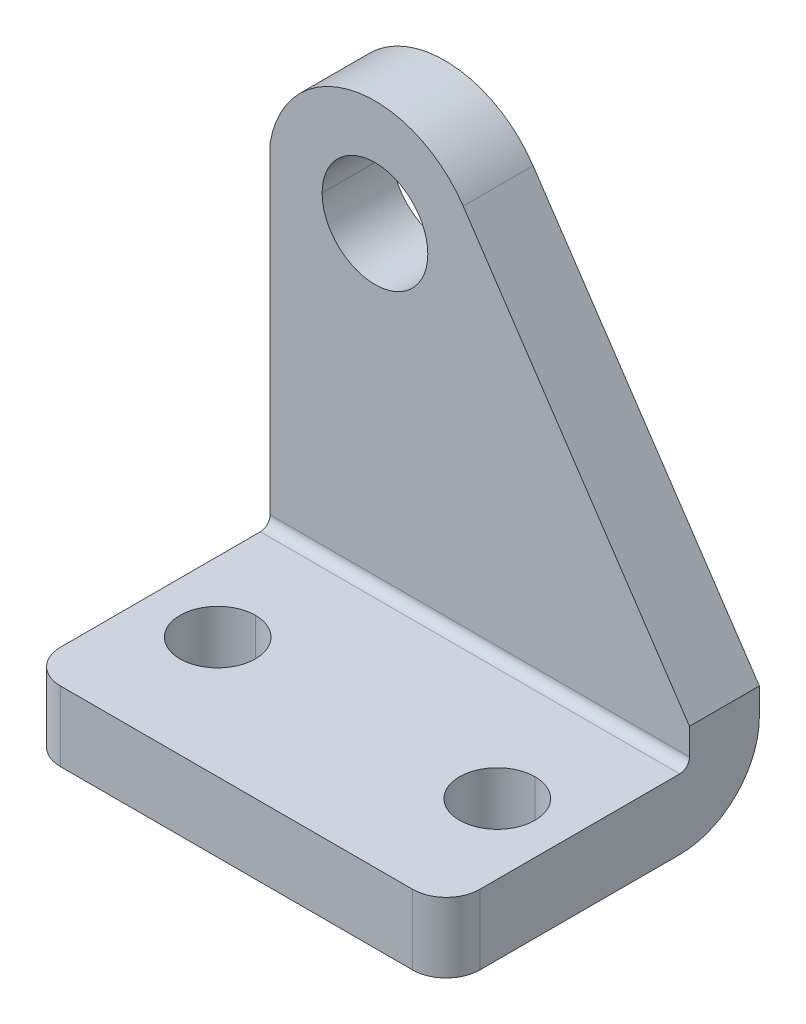
ISO-10303-21;
HEADER;
FILE_DESCRIPTION(('STEP AP214'),'2;1');
FILE_NAME('part.step','',(''),(''),'','','');
FILE_SCHEMA(('AUTOMOTIVE_DESIGN { 1 0 10303 214 1 1 1 1 }'));
ENDSEC;
DATA;
#1=APPLICATION_CONTEXT('core data for automotive mechanical design processes');
#2=APPLICATION_PROTOCOL_DEFINITION('international standard','automotive_design',2000,#1);
#3=PRODUCT_CONTEXT('',#1,'mechanical');
#4=PRODUCT('Part','Part','',(#3));
#5=PRODUCT_RELATED_PRODUCT_CATEGORY('part','',(#4));
#6=PRODUCT_DEFINITION_FORMATION('','',#4);
#7=PRODUCT_DEFINITION_CONTEXT('part definition',#1,'design');
#8=PRODUCT_DEFINITION('design','',#6,#7);
#9=PRODUCT_DEFINITION_SHAPE('','',#8);
#10=(LENGTH_UNIT() NAMED_UNIT(*) SI_UNIT(.MILLI.,.METRE.));
#11=(NAMED_UNIT(*) PLANE_ANGLE_UNIT() SI_UNIT($,.RADIAN.));
#12=(NAMED_UNIT(*) SI_UNIT($,.STERADIAN.) SOLID_ANGLE_UNIT());
#13=UNCERTAINTY_MEASURE_WITH_UNIT(LENGTH_MEASURE(1.E-05),#10,'distance_accuracy_value','');
#14=(GEOMETRIC_REPRESENTATION_CONTEXT(3) GLOBAL_UNCERTAINTY_ASSIGNED_CONTEXT((#13)) GLOBAL_UNIT_ASSIGNED_CONTEXT((#10,
#11,#12)) REPRESENTATION_CONTEXT('',''));
#15=CARTESIAN_POINT('',(0.,0.,0.));
#16=DIRECTION('',(0.,0.,1.));
#17=DIRECTION('',(1.,0.,0.));
#18=AXIS2_PLACEMENT_3D('',#15,#16,#17);
#19=CARTESIAN_POINT('',(38.1,6.35,7.239));
#20=DIRECTION('',(0.,-1.,0.));
#21=DIRECTION('',(0.,0.,-1.));
#22=AXIS2_PLACEMENT_3D('',#19,#20,#21);
#23=PLANE('',#22);
#24=CARTESIAN_POINT('',(6.35,6.35,17.4625));
#25=DIRECTION('',(0.,1.,0.));
#26=DIRECTION('',(0.,0.,1.));
#27=AXIS2_PLACEMENT_3D('',#24,#25,#26);
#28=CIRCLE('',#27,3.429);
#29=CARTESIAN_POINT('',(6.35,6.35,20.8915));
#30=VERTEX_POINT('',#29);
#31=CARTESIAN_POINT('',(6.35,6.35,14.0335));
#32=VERTEX_POINT('',#31);
#33=EDGE_CURVE('E10',#30,#32,#28,.T.);
#34=ORIENTED_EDGE('',*,*,#33,.F.);
#35=CARTESIAN_POINT('',(6.35,6.35,17.4625));
#36=DIRECTION('',(0.,1.,0.));
#37=DIRECTION('',(0.,0.,1.));
#38=AXIS2_PLACEMENT_3D('',#35,#36,#37);
#39=CIRCLE('',#38,3.429);
#40=EDGE_CURVE('E24',#32,#30,#39,.T.);
#41=ORIENTED_EDGE('',*,*,#40,.F.);
#42=EDGE_LOOP('',(#34,#41));
#43=FACE_BOUND('',#42,.T.);
#44=CARTESIAN_POINT('',(31.75,6.35,17.4625));
#45=DIRECTION('',(0.,1.,0.));
#46=DIRECTION('',(0.,0.,1.));
#47=AXIS2_PLACEMENT_3D('',#44,#45,#46);
#48=CIRCLE('',#47,3.429);
#49=CARTESIAN_POINT('',(31.75,6.35,20.8915));
#50=VERTEX_POINT('',#49);
#51=CARTESIAN_POINT('',(31.75,6.35,14.0335));
#52=VERTEX_POINT('',#51);
#53=EDGE_CURVE('E327',#50,#52,#48,.T.);
#54=ORIENTED_EDGE('',*,*,#53,.F.);
#55=CARTESIAN_POINT('',(31.75,6.35,17.4625));
#56=DIRECTION('',(0.,1.,0.));
#57=DIRECTION('',(0.,0.,1.));
#58=AXIS2_PLACEMENT_3D('',#55,#56,#57);
#59=CIRCLE('',#58,3.429);
#60=EDGE_CURVE('E322',#52,#50,#59,.T.);
#61=ORIENTED_EDGE('',*,*,#60,.F.);
#62=EDGE_LOOP('',(#54,#61));
#63=FACE_BOUND('',#62,.T.);
#64=DIRECTION('',(-1.,0.,0.));
#65=VECTOR('',#64,1.);
#66=CARTESIAN_POINT('',(38.1,6.35,28.448));
#67=LINE('',#66,#65);
#68=CARTESIAN_POINT('',(35.052,6.35,28.448));
#69=VERTEX_POINT('',#68);
#70=CARTESIAN_POINT('',(3.048,6.35,28.448));
#71=VERTEX_POINT('',#70);
#72=EDGE_CURVE('E317',#69,#71,#67,.T.);
#73=ORIENTED_EDGE('',*,*,#72,.F.);
#74=CARTESIAN_POINT('',(35.0520000000013,6.35,25.4000000000013));
#75=DIRECTION('',(0.,1.,0.));
#76=DIRECTION('',(1.,0.,0.));
#77=AXIS2_PLACEMENT_3D('',#74,#75,#76);
#78=CIRCLE('',#77,3.048);
#79=CARTESIAN_POINT('',(38.1,6.35,25.4));
#80=VERTEX_POINT('',#79);
#81=EDGE_CURVE('E313',#69,#80,#78,.T.);
#82=ORIENTED_EDGE('',*,*,#81,.T.);
#83=DIRECTION('',(0.,0.,1.));
#84=VECTOR('',#83,1.);
#85=CARTESIAN_POINT('',(38.1,6.35,7.239));
#86=LINE('',#85,#84);
#87=CARTESIAN_POINT('',(38.1,6.35,7.239));
#88=VERTEX_POINT('',#87);
#89=EDGE_CURVE('E308',#88,#80,#86,.T.);
#90=ORIENTED_EDGE('',*,*,#89,.F.);
#91=DIRECTION('',(-1.,0.,0.));
#92=VECTOR('',#91,1.);
#93=CARTESIAN_POINT('',(38.1,6.35,7.239));
#94=LINE('',#93,#92);
#95=CARTESIAN_POINT('',(0.,6.35,7.239));
#96=VERTEX_POINT('',#95);
#97=EDGE_CURVE('E304',#88,#96,#94,.T.);
#98=ORIENTED_EDGE('',*,*,#97,.T.);
#99=DIRECTION('',(0.,0.,1.));
#100=VECTOR('',#99,1.);
#101=CARTESIAN_POINT('',(0.,6.35,7.239));
#102=LINE('',#101,#100);
#103=CARTESIAN_POINT('',(0.,6.35,25.4));
#104=VERTEX_POINT('',#103);
#105=EDGE_CURVE('E300',#96,#104,#102,.T.);
#106=ORIENTED_EDGE('',*,*,#105,.T.);
#107=CARTESIAN_POINT('',(3.04799999999929,6.35,25.4000000000008));
#108=DIRECTION('',(0.,1.,0.));
#109=DIRECTION('',(1.,0.,0.));
#110=AXIS2_PLACEMENT_3D('',#107,#108,#109);
#111=CIRCLE('',#110,3.048);
#112=EDGE_CURVE('E296',#104,#71,#111,.T.);
#113=ORIENTED_EDGE('',*,*,#112,.T.);
#114=EDGE_LOOP('',(#73,#82,#90,#98,#106,#113));
#115=FACE_BOUND('',#114,.T.);
#116=ADVANCED_FACE('F16',(#43,#63,#115),#23,.F.);
#117=CARTESIAN_POINT('',(3.04799999999929,6.35,25.4000000000008));
#118=DIRECTION('',(0.,1.,0.));
#119=DIRECTION('',(0.707106781186553,0.,-0.707106781186542));
#120=AXIS2_PLACEMENT_3D('',#117,#118,#119);
#121=CYLINDRICAL_SURFACE('',#120,3.048);
#122=CARTESIAN_POINT('',(3.04799999999929,0.,25.4000000000008));
#123=DIRECTION('',(0.,1.,0.));
#124=DIRECTION('',(1.,0.,0.));
#125=AXIS2_PLACEMENT_3D('',#122,#123,#124);
#126=CIRCLE('',#125,3.048);
#127=CARTESIAN_POINT('',(0.,0.,25.4));
#128=VERTEX_POINT('',#127);
#129=CARTESIAN_POINT('',(3.048,0.,28.448));
#130=VERTEX_POINT('',#129);
#131=EDGE_CURVE('E292',#128,#130,#126,.T.);
#132=ORIENTED_EDGE('',*,*,#131,.T.);
#133=DIRECTION('',(0.,-1.,0.));
#134=VECTOR('',#133,1.);
#135=CARTESIAN_POINT('',(3.048,6.35,28.448));
#136=LINE('',#135,#134);
#137=EDGE_CURVE('E287',#71,#130,#136,.T.);
#138=ORIENTED_EDGE('',*,*,#137,.F.);
#139=ORIENTED_EDGE('',*,*,#112,.F.);
#140=DIRECTION('',(0.,-1.,0.));
#141=VECTOR('',#140,1.);
#142=CARTESIAN_POINT('',(0.,6.35,25.4));
#143=LINE('',#142,#141);
#144=EDGE_CURVE('E283',#104,#128,#143,.T.);
#145=ORIENTED_EDGE('',*,*,#144,.T.);
#146=EDGE_LOOP('',(#132,#138,#139,#145));
#147=FACE_BOUND('',#146,.T.);
#148=ADVANCED_FACE('F411',(#147),#121,.T.);
#149=CARTESIAN_POINT('',(0.,7.23900000000005,7.23900000000005));
#150=DIRECTION('',(1.,0.,0.));
#151=DIRECTION('',(0.,0.,-1.));
#152=AXIS2_PLACEMENT_3D('',#149,#150,#151);
#153=PLANE('',#152);
#154=DIRECTION('',(0.,1.,0.));
#155=VECTOR('',#154,1.);
#156=CARTESIAN_POINT('',(0.,7.239,0.));
#157=LINE('',#156,#155);
#158=CARTESIAN_POINT('',(0.,7.239,0.));
#159=VERTEX_POINT('',#158);
#160=CARTESIAN_POINT('',(0.,36.4856021273851,0.));
#161=VERTEX_POINT('',#160);
#162=EDGE_CURVE('E278',#159,#161,#157,.T.);
#163=ORIENTED_EDGE('',*,*,#162,.F.);
#164=CARTESIAN_POINT('',(0.,7.23900000000005,7.23900000000005));
#165=DIRECTION('',(1.,0.,0.));
#166=DIRECTION('',(0.,0.,-1.));
#167=AXIS2_PLACEMENT_3D('',#164,#165,#166);
#168=CIRCLE('',#167,7.239);
#169=CARTESIAN_POINT('',(0.,0.,7.239));
#170=VERTEX_POINT('',#169);
#171=EDGE_CURVE('E273',#170,#159,#168,.T.);
#172=ORIENTED_EDGE('',*,*,#171,.F.);
#173=DIRECTION('',(0.,0.,-1.));
#174=VECTOR('',#173,1.);
#175=CARTESIAN_POINT('',(0.,0.,28.448));
#176=LINE('',#175,#174);
#177=EDGE_CURVE('E268',#128,#170,#176,.T.);
#178=ORIENTED_EDGE('',*,*,#177,.F.);
#179=ORIENTED_EDGE('',*,*,#144,.F.);
#180=ORIENTED_EDGE('',*,*,#105,.F.);
#181=CARTESIAN_POINT('',(0.,7.23900000000015,7.23900000000015));
#182=DIRECTION('',(1.,0.,0.));
#183=DIRECTION('',(0.,0.,-1.));
#184=AXIS2_PLACEMENT_3D('',#181,#182,#183);
#185=CIRCLE('',#184,0.889);
#186=CARTESIAN_POINT('',(0.,7.239,6.35));
#187=VERTEX_POINT('',#186);
#188=EDGE_CURVE('E264',#96,#187,#185,.T.);
#189=ORIENTED_EDGE('',*,*,#188,.T.);
#190=DIRECTION('',(0.,-1.,0.));
#191=VECTOR('',#190,1.);
#192=CARTESIAN_POINT('',(0.,45.72,6.35));
#193=LINE('',#192,#191);
#194=CARTESIAN_POINT('',(0.,36.4856021273851,6.35));
#195=VERTEX_POINT('',#194);
#196=EDGE_CURVE('E259',#195,#187,#193,.T.);
#197=ORIENTED_EDGE('',*,*,#196,.F.);
#198=DIRECTION('',(0.,0.,-1.));
#199=VECTOR('',#198,1.);
#200=CARTESIAN_POINT('',(0.,36.4856021273851,6.35));
#201=LINE('',#200,#199);
#202=EDGE_CURVE('E255',#195,#161,#201,.T.);
#203=ORIENTED_EDGE('',*,*,#202,.T.);
#204=EDGE_LOOP('',(#163,#172,#178,#179,#180,#189,#197,#203));
#205=FACE_BOUND('',#204,.T.);
#206=ADVANCED_FACE('F396',(#205),#153,.F.);
#207=CARTESIAN_POINT('',(9.52500000000025,34.9249999999995,6.35));
#208=DIRECTION('',(0.,0.,1.));
#209=DIRECTION('',(0.212588316482743,-0.977141856485041,0.));
#210=AXIS2_PLACEMENT_3D('',#207,#208,#209);
#211=CYLINDRICAL_SURFACE('',#210,9.652);
#212=CARTESIAN_POINT('',(9.52500000000025,34.9249999999995,6.35));
#213=DIRECTION('',(0.,0.,1.));
#214=DIRECTION('',(1.,0.,0.));
#215=AXIS2_PLACEMENT_3D('',#212,#213,#214);
#216=CIRCLE('',#215,9.652);
#217=CARTESIAN_POINT('',(17.540693798248,40.3017794201301,6.35));
#218=VERTEX_POINT('',#217);
#219=EDGE_CURVE('E250',#218,#195,#216,.T.);
#220=ORIENTED_EDGE('',*,*,#219,.F.);
#221=DIRECTION('',(0.,0.,-1.));
#222=VECTOR('',#221,1.);
#223=CARTESIAN_POINT('',(17.540693798248,40.3017794201301,6.35));
#224=LINE('',#223,#222);
#225=CARTESIAN_POINT('',(17.540693798248,40.3017794201301,0.));
#226=VERTEX_POINT('',#225);
#227=EDGE_CURVE('E246',#218,#226,#224,.T.);
#228=ORIENTED_EDGE('',*,*,#227,.T.);
#229=CARTESIAN_POINT('',(9.52500000000025,34.9249999999995,0.));
#230=DIRECTION('',(0.,0.,1.));
#231=DIRECTION('',(1.,0.,0.));
#232=AXIS2_PLACEMENT_3D('',#229,#230,#231);
#233=CIRCLE('',#232,9.652);
#234=EDGE_CURVE('E241',#226,#161,#233,.T.);
#235=ORIENTED_EDGE('',*,*,#234,.T.);
#236=ORIENTED_EDGE('',*,*,#202,.F.);
#237=EDGE_LOOP('',(#220,#228,#235,#236));
#238=FACE_BOUND('',#237,.T.);
#239=ADVANCED_FACE('F401',(#238),#211,.T.);
#240=CARTESIAN_POINT('',(38.1,7.239,0.));
#241=DIRECTION('',(0.,0.,1.));
#242=DIRECTION('',(1.,0.,0.));
#243=AXIS2_PLACEMENT_3D('',#240,#241,#242);
#244=PLANE('',#243);
#245=CARTESIAN_POINT('',(9.525,34.925,0.));
#246=DIRECTION('',(0.,0.,-1.));
#247=DIRECTION('',(-1.,0.,0.));
#248=AXIS2_PLACEMENT_3D('',#245,#246,#247);
#249=CIRCLE('',#248,4.8006);
#250=CARTESIAN_POINT('',(4.7244,34.925,0.));
#251=VERTEX_POINT('',#250);
#252=CARTESIAN_POINT('',(14.3256,34.925,0.));
#253=VERTEX_POINT('',#252);
#254=EDGE_CURVE('E237',#251,#253,#249,.T.);
#255=ORIENTED_EDGE('',*,*,#254,.F.);
#256=CARTESIAN_POINT('',(9.525,34.925,0.));
#257=DIRECTION('',(0.,0.,-1.));
#258=DIRECTION('',(-1.,0.,0.));
#259=AXIS2_PLACEMENT_3D('',#256,#257,#258);
#260=CIRCLE('',#259,4.8006);
#261=EDGE_CURVE('E144',#253,#251,#260,.T.);
#262=ORIENTED_EDGE('',*,*,#261,.F.);
#263=EDGE_LOOP('',(#255,#262));
#264=FACE_BOUND('',#263,.T.);
#265=ORIENTED_EDGE('',*,*,#162,.T.);
#266=ORIENTED_EDGE('',*,*,#234,.F.);
#267=DIRECTION('',(0.557063760891996,-0.830469726300041,0.));
#268=VECTOR('',#267,1.);
#269=CARTESIAN_POINT('',(17.540693798248,40.3017794201301,0.));
#270=LINE('',#269,#268);
#271=CARTESIAN_POINT('',(38.1,9.652,0.));
#272=VERTEX_POINT('',#271);
#273=EDGE_CURVE('E230',#226,#272,#270,.T.);
#274=ORIENTED_EDGE('',*,*,#273,.T.);
#275=DIRECTION('',(0.,1.,0.));
#276=VECTOR('',#275,1.);
#277=CARTESIAN_POINT('',(38.1,7.239,0.));
#278=LINE('',#277,#276);
#279=CARTESIAN_POINT('',(38.1,7.239,0.));
#280=VERTEX_POINT('',#279);
#281=EDGE_CURVE('E225',#280,#272,#278,.T.);
#282=ORIENTED_EDGE('',*,*,#281,.F.);
#283=DIRECTION('',(-1.,0.,0.));
#284=VECTOR('',#283,1.);
#285=CARTESIAN_POINT('',(38.1,7.239,0.));
#286=LINE('',#285,#284);
#287=EDGE_CURVE('E220',#280,#159,#286,.T.);
#288=ORIENTED_EDGE('',*,*,#287,.T.);
#289=EDGE_LOOP('',(#265,#266,#274,#282,#288));
#290=FACE_BOUND('',#289,.T.);
#291=ADVANCED_FACE('F389',(#264,#290),#244,.F.);
#292=CARTESIAN_POINT('',(38.1,7.23900000000005,7.23900000000005));
#293=DIRECTION('',(1.,0.,0.));
#294=DIRECTION('',(0.,0.707106781186545,0.70710678118655));
#295=AXIS2_PLACEMENT_3D('',#292,#293,#294);
#296=CYLINDRICAL_SURFACE('',#295,7.239);
#297=ORIENTED_EDGE('',*,*,#171,.T.);
#298=ORIENTED_EDGE('',*,*,#287,.F.);
#299=CARTESIAN_POINT('',(38.1,7.23900000000005,7.23900000000005));
#300=DIRECTION('',(1.,0.,0.));
#301=DIRECTION('',(0.,0.,-1.));
#302=AXIS2_PLACEMENT_3D('',#299,#300,#301);
#303=CIRCLE('',#302,7.239);
#304=CARTESIAN_POINT('',(38.1,0.,7.239));
#305=VERTEX_POINT('',#304);
#306=EDGE_CURVE('E215',#305,#280,#303,.T.);
#307=ORIENTED_EDGE('',*,*,#306,.F.);
#308=DIRECTION('',(-1.,0.,0.));
#309=VECTOR('',#308,1.);
#310=CARTESIAN_POINT('',(38.1,0.,7.239));
#311=LINE('',#310,#309);
#312=EDGE_CURVE('E210',#305,#170,#311,.T.);
#313=ORIENTED_EDGE('',*,*,#312,.T.);
#314=EDGE_LOOP('',(#297,#298,#307,#313));
#315=FACE_BOUND('',#314,.T.);
#316=ADVANCED_FACE('F392',(#315),#296,.T.);
#317=CARTESIAN_POINT('',(38.1,0.,28.448));
#318=DIRECTION('',(0.,1.,0.));
#319=DIRECTION('',(0.,0.,1.));
#320=AXIS2_PLACEMENT_3D('',#317,#318,#319);
#321=PLANE('',#320);
#322=CARTESIAN_POINT('',(6.35,0.,17.4625));
#323=DIRECTION('',(0.,1.,0.));
#324=DIRECTION('',(0.,0.,1.));
#325=AXIS2_PLACEMENT_3D('',#322,#323,#324);
#326=CIRCLE('',#325,3.429);
#327=CARTESIAN_POINT('',(6.35,0.,20.8915));
#328=VERTEX_POINT('',#327);
#329=CARTESIAN_POINT('',(6.35,0.,14.0335));
#330=VERTEX_POINT('',#329);
#331=EDGE_CURVE('E206',#328,#330,#326,.T.);
#332=ORIENTED_EDGE('',*,*,#331,.T.);
#333=CARTESIAN_POINT('',(6.35,0.,17.4625));
#334=DIRECTION('',(0.,1.,0.));
#335=DIRECTION('',(0.,0.,1.));
#336=AXIS2_PLACEMENT_3D('',#333,#334,#335);
#337=CIRCLE('',#336,3.429);
#338=EDGE_CURVE('E202',#330,#328,#337,.T.);
#339=ORIENTED_EDGE('',*,*,#338,.T.);
#340=EDGE_LOOP('',(#332,#339));
#341=FACE_BOUND('',#340,.T.);
#342=CARTESIAN_POINT('',(31.75,0.,17.4625));
#343=DIRECTION('',(0.,1.,0.));
#344=DIRECTION('',(0.,0.,1.));
#345=AXIS2_PLACEMENT_3D('',#342,#343,#344);
#346=CIRCLE('',#345,3.429);
#347=CARTESIAN_POINT('',(31.75,0.,20.8915));
#348=VERTEX_POINT('',#347);
#349=CARTESIAN_POINT('',(31.75,0.,14.0335));
#350=VERTEX_POINT('',#349);
#351=EDGE_CURVE('E198',#348,#350,#346,.T.);
#352=ORIENTED_EDGE('',*,*,#351,.T.);
#353=CARTESIAN_POINT('',(31.75,0.,17.4625));
#354=DIRECTION('',(0.,1.,0.));
#355=DIRECTION('',(0.,0.,1.));
#356=AXIS2_PLACEMENT_3D('',#353,#354,#355);
#357=CIRCLE('',#356,3.429);
#358=EDGE_CURVE('E194',#350,#348,#357,.T.);
#359=ORIENTED_EDGE('',*,*,#358,.T.);
#360=EDGE_LOOP('',(#352,#359));
#361=FACE_BOUND('',#360,.T.);
#362=DIRECTION('',(0.,0.,-1.));
#363=VECTOR('',#362,1.);
#364=CARTESIAN_POINT('',(38.1,0.,28.448));
#365=LINE('',#364,#363);
#366=CARTESIAN_POINT('',(38.1,0.,25.4));
#367=VERTEX_POINT('',#366);
#368=EDGE_CURVE('E189',#367,#305,#365,.T.);
#369=ORIENTED_EDGE('',*,*,#368,.F.);
#370=CARTESIAN_POINT('',(35.0520000000013,0.,25.4000000000013));
#371=DIRECTION('',(0.,1.,0.));
#372=DIRECTION('',(1.,0.,0.));
#373=AXIS2_PLACEMENT_3D('',#370,#371,#372);
#374=CIRCLE('',#373,3.048);
#375=CARTESIAN_POINT('',(35.052,0.,28.448));
#376=VERTEX_POINT('',#375);
#377=EDGE_CURVE('E184',#376,#367,#374,.T.);
#378=ORIENTED_EDGE('',*,*,#377,.F.);
#379=DIRECTION('',(-1.,0.,0.));
#380=VECTOR('',#379,1.);
#381=CARTESIAN_POINT('',(38.1,0.,28.448));
#382=LINE('',#381,#380);
#383=EDGE_CURVE('E179',#376,#130,#382,.T.);
#384=ORIENTED_EDGE('',*,*,#383,.T.);
#385=ORIENTED_EDGE('',*,*,#131,.F.);
#386=ORIENTED_EDGE('',*,*,#177,.T.);
#387=ORIENTED_EDGE('',*,*,#312,.F.);
#388=EDGE_LOOP('',(#369,#378,#384,#385,#386,#387));
#389=FACE_BOUND('',#388,.T.);
#390=ADVANCED_FACE('F450',(#341,#361,#389),#321,.F.);
#391=CARTESIAN_POINT('',(38.1,6.35,28.448));
#392=DIRECTION('',(0.,0.,-1.));
#393=DIRECTION('',(-1.,0.,0.));
#394=AXIS2_PLACEMENT_3D('',#391,#392,#393);
#395=PLANE('',#394);
#396=ORIENTED_EDGE('',*,*,#383,.F.);
#397=DIRECTION('',(0.,-1.,0.));
#398=VECTOR('',#397,1.);
#399=CARTESIAN_POINT('',(35.052,6.35,28.448));
#400=LINE('',#399,#398);
#401=EDGE_CURVE('E174',#69,#376,#400,.T.);
#402=ORIENTED_EDGE('',*,*,#401,.F.);
#403=ORIENTED_EDGE('',*,*,#72,.T.);
#404=ORIENTED_EDGE('',*,*,#137,.T.);
#405=EDGE_LOOP('',(#396,#402,#403,#404));
#406=FACE_BOUND('',#405,.T.);
#407=ADVANCED_FACE('F427',(#406),#395,.F.);
#408=CARTESIAN_POINT('',(35.0520000000013,6.35,25.4000000000013));
#409=DIRECTION('',(0.,1.,0.));
#410=DIRECTION('',(-0.707106781186546,0.,-0.707106781186549));
#411=AXIS2_PLACEMENT_3D('',#408,#409,#410);
#412=CYLINDRICAL_SURFACE('',#411,3.048);
#413=ORIENTED_EDGE('',*,*,#377,.T.);
#414=DIRECTION('',(0.,-1.,0.));
#415=VECTOR('',#414,1.);
#416=CARTESIAN_POINT('',(38.1,6.35,25.4));
#417=LINE('',#416,#415);
#418=EDGE_CURVE('E169',#80,#367,#417,.T.);
#419=ORIENTED_EDGE('',*,*,#418,.F.);
#420=ORIENTED_EDGE('',*,*,#81,.F.);
#421=ORIENTED_EDGE('',*,*,#401,.T.);
#422=EDGE_LOOP('',(#413,#419,#420,#421));
#423=FACE_BOUND('',#422,.T.);
#424=ADVANCED_FACE('F429',(#423),#412,.T.);
#425=CARTESIAN_POINT('',(38.1,7.23900000000005,7.23900000000005));
#426=DIRECTION('',(1.,0.,0.));
#427=DIRECTION('',(0.,0.,-1.));
#428=AXIS2_PLACEMENT_3D('',#425,#426,#427);
#429=PLANE('',#428);
#430=CARTESIAN_POINT('',(38.1,7.23900000000015,7.23900000000015));
#431=DIRECTION('',(1.,0.,0.));
#432=DIRECTION('',(0.,0.,-1.));
#433=AXIS2_PLACEMENT_3D('',#430,#431,#432);
#434=CIRCLE('',#433,0.889);
#435=CARTESIAN_POINT('',(38.1,7.239,6.35));
#436=VERTEX_POINT('',#435);
#437=EDGE_CURVE('E164',#88,#436,#434,.T.);
#438=ORIENTED_EDGE('',*,*,#437,.F.);
#439=ORIENTED_EDGE('',*,*,#89,.T.);
#440=ORIENTED_EDGE('',*,*,#418,.T.);
#441=ORIENTED_EDGE('',*,*,#368,.T.);
#442=ORIENTED_EDGE('',*,*,#306,.T.);
#443=ORIENTED_EDGE('',*,*,#281,.T.);
#444=DIRECTION('',(0.,0.,-1.));
#445=VECTOR('',#444,1.);
#446=CARTESIAN_POINT('',(38.1,9.652,6.35));
#447=LINE('',#446,#445);
#448=CARTESIAN_POINT('',(38.1,9.652,6.35));
#449=VERTEX_POINT('',#448);
#450=EDGE_CURVE('E153',#449,#272,#447,.T.);
#451=ORIENTED_EDGE('',*,*,#450,.F.);
#452=DIRECTION('',(0.,-1.,0.));
#453=VECTOR('',#452,1.);
#454=CARTESIAN_POINT('',(38.1,45.72,6.35));
#455=LINE('',#454,#453);
#456=EDGE_CURVE('E151',#449,#436,#455,.T.);
#457=ORIENTED_EDGE('',*,*,#456,.T.);
#458=EDGE_LOOP('',(#438,#439,#440,#441,#442,#443,#451,#457));
#459=FACE_BOUND('',#458,.T.);
#460=ADVANCED_FACE('F385',(#459),#429,.T.);
#461=CARTESIAN_POINT('',(38.1,45.72,6.35));
#462=DIRECTION('',(0.,0.,-1.));
#463=DIRECTION('',(-1.,0.,0.));
#464=AXIS2_PLACEMENT_3D('',#461,#462,#463);
#465=PLANE('',#464);
#466=CARTESIAN_POINT('',(9.525,34.925,6.35));
#467=DIRECTION('',(0.,0.,-1.));
#468=DIRECTION('',(-1.,0.,0.));
#469=AXIS2_PLACEMENT_3D('',#466,#467,#468);
#470=CIRCLE('',#469,4.8006);
#471=CARTESIAN_POINT('',(4.7244,34.925,6.35));
#472=VERTEX_POINT('',#471);
#473=CARTESIAN_POINT('',(14.3256,34.925,6.35));
#474=VERTEX_POINT('',#473);
#475=EDGE_CURVE('E134',#472,#474,#470,.T.);
#476=ORIENTED_EDGE('',*,*,#475,.T.);
#477=CARTESIAN_POINT('',(9.525,34.925,6.35));
#478=DIRECTION('',(0.,0.,-1.));
#479=DIRECTION('',(-1.,0.,0.));
#480=AXIS2_PLACEMENT_3D('',#477,#478,#479);
#481=CIRCLE('',#480,4.8006);
#482=EDGE_CURVE('E129',#474,#472,#481,.T.);
#483=ORIENTED_EDGE('',*,*,#482,.T.);
#484=EDGE_LOOP('',(#476,#483));
#485=FACE_BOUND('',#484,.T.);
#486=DIRECTION('',(0.557063760891996,-0.830469726300041,0.));
#487=VECTOR('',#486,1.);
#488=CARTESIAN_POINT('',(17.540693798248,40.3017794201301,6.35));
#489=LINE('',#488,#487);
#490=EDGE_CURVE('E138',#218,#449,#489,.T.);
#491=ORIENTED_EDGE('',*,*,#490,.F.);
#492=ORIENTED_EDGE('',*,*,#219,.T.);
#493=ORIENTED_EDGE('',*,*,#196,.T.);
#494=DIRECTION('',(-1.,0.,0.));
#495=VECTOR('',#494,1.);
#496=CARTESIAN_POINT('',(38.1,7.239,6.35));
#497=LINE('',#496,#495);
#498=EDGE_CURVE('E366',#436,#187,#497,.T.);
#499=ORIENTED_EDGE('',*,*,#498,.F.);
#500=ORIENTED_EDGE('',*,*,#456,.F.);
#501=EDGE_LOOP('',(#491,#492,#493,#499,#500));
#502=FACE_BOUND('',#501,.T.);
#503=ADVANCED_FACE('F131',(#485,#502),#465,.F.);
#504=CARTESIAN_POINT('',(38.1,7.23900000000015,7.23900000000015));
#505=DIRECTION('',(1.,0.,0.));
#506=DIRECTION('',(0.,0.707106781186487,0.707106781186608));
#507=AXIS2_PLACEMENT_3D('',#504,#505,#506);
#508=CYLINDRICAL_SURFACE('',#507,0.889);
#509=ORIENTED_EDGE('',*,*,#498,.T.);
#510=ORIENTED_EDGE('',*,*,#188,.F.);
#511=ORIENTED_EDGE('',*,*,#97,.F.);
#512=ORIENTED_EDGE('',*,*,#437,.T.);
#513=EDGE_LOOP('',(#509,#510,#511,#512));
#514=FACE_BOUND('',#513,.T.);
#515=ADVANCED_FACE('F433',(#514),#508,.F.);
#516=CARTESIAN_POINT('',(17.540693798248,40.3017794201301,6.35));
#517=DIRECTION('',(0.830469726300041,0.557063760891996,0.));
#518=DIRECTION('',(-0.557063760891996,0.830469726300041,0.));
#519=AXIS2_PLACEMENT_3D('',#516,#517,#518);
#520=PLANE('',#519);
#521=ORIENTED_EDGE('',*,*,#273,.F.);
#522=ORIENTED_EDGE('',*,*,#227,.F.);
#523=ORIENTED_EDGE('',*,*,#490,.T.);
#524=ORIENTED_EDGE('',*,*,#450,.T.);
#525=EDGE_LOOP('',(#521,#522,#523,#524));
#526=FACE_BOUND('',#525,.T.);
#527=ADVANCED_FACE('F380',(#526),#520,.T.);
#528=CARTESIAN_POINT('',(9.525,34.925,0.));
#529=DIRECTION('',(0.,0.,1.));
#530=DIRECTION('',(0.,1.,0.));
#531=AXIS2_PLACEMENT_3D('',#528,#529,#530);
#532=CYLINDRICAL_SURFACE('',#531,4.8006);
#533=ORIENTED_EDGE('',*,*,#482,.F.);
#534=DIRECTION('',(0.,0.,1.));
#535=VECTOR('',#534,1.);
#536=CARTESIAN_POINT('',(14.3256,34.925,0.));
#537=LINE('',#536,#535);
#538=EDGE_CURVE('E147',#253,#474,#537,.T.);
#539=ORIENTED_EDGE('',*,*,#538,.F.);
#540=ORIENTED_EDGE('',*,*,#261,.T.);
#541=DIRECTION('',(0.,0.,1.));
#542=VECTOR('',#541,1.);
#543=CARTESIAN_POINT('',(4.7244,34.925,0.));
#544=LINE('',#543,#542);
#545=EDGE_CURVE('E142',#251,#472,#544,.T.);
#546=ORIENTED_EDGE('',*,*,#545,.T.);
#547=EDGE_LOOP('',(#533,#539,#540,#546));
#548=FACE_BOUND('',#547,.T.);
#549=ADVANCED_FACE('F143',(#548),#532,.F.);
#550=CARTESIAN_POINT('',(9.525,34.925,0.));
#551=DIRECTION('',(0.,0.,1.));
#552=DIRECTION('',(0.,-1.,0.));
#553=AXIS2_PLACEMENT_3D('',#550,#551,#552);
#554=CYLINDRICAL_SURFACE('',#553,4.8006);
#555=ORIENTED_EDGE('',*,*,#254,.T.);
#556=ORIENTED_EDGE('',*,*,#538,.T.);
#557=ORIENTED_EDGE('',*,*,#475,.F.);
#558=ORIENTED_EDGE('',*,*,#545,.F.);
#559=EDGE_LOOP('',(#555,#556,#557,#558));
#560=FACE_BOUND('',#559,.T.);
#561=ADVANCED_FACE('F150',(#560),#554,.F.);
#562=CARTESIAN_POINT('',(31.75,6.35,17.4625));
#563=DIRECTION('',(0.,-1.,0.));
#564=DIRECTION('',(1.,0.,0.));
#565=AXIS2_PLACEMENT_3D('',#562,#563,#564);
#566=CYLINDRICAL_SURFACE('',#565,3.429);
#567=ORIENTED_EDGE('',*,*,#358,.F.);
#568=DIRECTION('',(0.,-1.,0.));
#569=VECTOR('',#568,1.);
#570=CARTESIAN_POINT('',(31.75,6.35,14.0335));
#571=LINE('',#570,#569);
#572=EDGE_CURVE('E148',#52,#350,#571,.T.);
#573=ORIENTED_EDGE('',*,*,#572,.F.);
#574=ORIENTED_EDGE('',*,*,#60,.T.);
#575=DIRECTION('',(0.,-1.,0.));
#576=VECTOR('',#575,1.);
#577=CARTESIAN_POINT('',(31.75,6.35,20.8915));
#578=LINE('',#577,#576);
#579=EDGE_CURVE('E348',#50,#348,#578,.T.);
#580=ORIENTED_EDGE('',*,*,#579,.T.);
#581=EDGE_LOOP('',(#567,#573,#574,#580));
#582=FACE_BOUND('',#581,.T.);
#583=ADVANCED_FACE('F509',(#582),#566,.F.);
#584=CARTESIAN_POINT('',(31.75,6.35,17.4625));
#585=DIRECTION('',(0.,-1.,0.));
#586=DIRECTION('',(-1.,0.,0.));
#587=AXIS2_PLACEMENT_3D('',#584,#585,#586);
#588=CYLINDRICAL_SURFACE('',#587,3.429);
#589=ORIENTED_EDGE('',*,*,#53,.T.);
#590=ORIENTED_EDGE('',*,*,#572,.T.);
#591=ORIENTED_EDGE('',*,*,#351,.F.);
#592=ORIENTED_EDGE('',*,*,#579,.F.);
#593=EDGE_LOOP('',(#589,#590,#591,#592));
#594=FACE_BOUND('',#593,.T.);
#595=ADVANCED_FACE('F518',(#594),#588,.F.);
#596=CARTESIAN_POINT('',(6.35,6.35,17.4625));
#597=DIRECTION('',(0.,-1.,0.));
#598=DIRECTION('',(1.,0.,0.));
#599=AXIS2_PLACEMENT_3D('',#596,#597,#598);
#600=CYLINDRICAL_SURFACE('',#599,3.429);
#601=ORIENTED_EDGE('',*,*,#338,.F.);
#602=DIRECTION('',(0.,-1.,0.));
#603=VECTOR('',#602,1.);
#604=CARTESIAN_POINT('',(6.35,6.35,14.0335));
#605=LINE('',#604,#603);
#606=EDGE_CURVE('E344',#32,#330,#605,.T.);
#607=ORIENTED_EDGE('',*,*,#606,.F.);
#608=ORIENTED_EDGE('',*,*,#40,.T.);
#609=DIRECTION('',(0.,-1.,0.));
#610=VECTOR('',#609,1.);
#611=CARTESIAN_POINT('',(6.35,6.35,20.8915));
#612=LINE('',#611,#610);
#613=EDGE_CURVE('E341',#30,#328,#612,.T.);
#614=ORIENTED_EDGE('',*,*,#613,.T.);
#615=EDGE_LOOP('',(#601,#607,#608,#614));
#616=FACE_BOUND('',#615,.T.);
#617=ADVANCED_FACE('F340',(#616),#600,.F.);
#618=CARTESIAN_POINT('',(6.35,6.35,17.4625));
#619=DIRECTION('',(0.,-1.,0.));
#620=DIRECTION('',(-1.,0.,0.));
#621=AXIS2_PLACEMENT_3D('',#618,#619,#620);
#622=CYLINDRICAL_SURFACE('',#621,3.429);
#623=ORIENTED_EDGE('',*,*,#33,.T.);
#624=ORIENTED_EDGE('',*,*,#606,.T.);
#625=ORIENTED_EDGE('',*,*,#331,.F.);
#626=ORIENTED_EDGE('',*,*,#613,.F.);
#627=EDGE_LOOP('',(#623,#624,#625,#626));
#628=FACE_BOUND('',#627,.T.);
#629=ADVANCED_FACE('F346',(#628),#622,.F.);
#630=CLOSED_SHELL('',(#116,#148,#206,#239,#291,#316,#390,#407,#424,#460,#503,#515,#527,#549,
#561,#583,#595,#617,#629));
#631=MANIFOLD_SOLID_BREP('B1',#630);
#632=ADVANCED_BREP_SHAPE_REPRESENTATION('',(#18,#631),#14);
#633=SHAPE_DEFINITION_REPRESENTATION(#9,#632);
ENDSEC;
END-ISO-10303-21;
